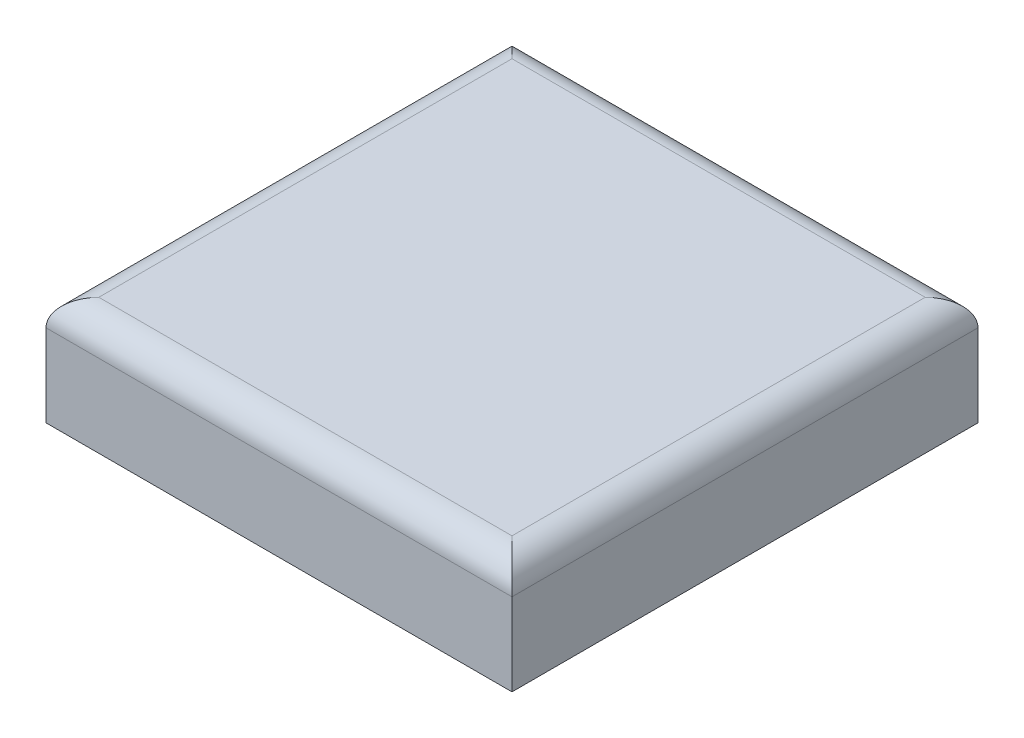
ISO-10303-21;
HEADER;
FILE_DESCRIPTION(('STEP AP214'),'2;1');
FILE_NAME('part.step','',(''),(''),'','','');
FILE_SCHEMA(('AUTOMOTIVE_DESIGN { 1 0 10303 214 1 1 1 1 }'));
ENDSEC;
DATA;
#1=APPLICATION_CONTEXT('core data for automotive mechanical design processes');
#2=APPLICATION_PROTOCOL_DEFINITION('international standard','automotive_design',2000,#1);
#3=PRODUCT_CONTEXT('',#1,'mechanical');
#4=PRODUCT('Part','Part','',(#3));
#5=PRODUCT_RELATED_PRODUCT_CATEGORY('part','',(#4));
#6=PRODUCT_DEFINITION_FORMATION('','',#4);
#7=PRODUCT_DEFINITION_CONTEXT('part definition',#1,'design');
#8=PRODUCT_DEFINITION('design','',#6,#7);
#9=PRODUCT_DEFINITION_SHAPE('','',#8);
#10=(LENGTH_UNIT() NAMED_UNIT(*) SI_UNIT(.MILLI.,.METRE.));
#11=(NAMED_UNIT(*) PLANE_ANGLE_UNIT() SI_UNIT($,.RADIAN.));
#12=(NAMED_UNIT(*) SI_UNIT($,.STERADIAN.) SOLID_ANGLE_UNIT());
#13=UNCERTAINTY_MEASURE_WITH_UNIT(LENGTH_MEASURE(1.E-05),#10,'distance_accuracy_value','');
#14=(GEOMETRIC_REPRESENTATION_CONTEXT(3) GLOBAL_UNCERTAINTY_ASSIGNED_CONTEXT((#13)) GLOBAL_UNIT_ASSIGNED_CONTEXT((#10,
#11,#12)) REPRESENTATION_CONTEXT('',''));
#15=CARTESIAN_POINT('',(0.,0.,0.));
#16=DIRECTION('',(0.,0.,1.));
#17=DIRECTION('',(1.,0.,0.));
#18=AXIS2_PLACEMENT_3D('',#15,#16,#17);
#19=CARTESIAN_POINT('',(0.,700.,0.));
#20=DIRECTION('',(1.,0.,0.));
#21=DIRECTION('',(0.,0.,-1.));
#22=AXIS2_PLACEMENT_3D('',#19,#20,#21);
#23=PLANE('',#22);
#24=DIRECTION('',(0.,-1.,0.));
#25=VECTOR('',#24,1.);
#26=CARTESIAN_POINT('',(0.,700.,0.));
#27=LINE('',#26,#25);
#28=CARTESIAN_POINT('',(0.,530.,0.));
#29=VERTEX_POINT('',#28);
#30=CARTESIAN_POINT('',(0.,0.,0.));
#31=VERTEX_POINT('',#30);
#32=EDGE_CURVE('E87',#29,#31,#27,.T.);
#33=ORIENTED_EDGE('',*,*,#32,.F.);
#34=DIRECTION('',(0.,0.,1.));
#35=VECTOR('',#34,1.);
#36=CARTESIAN_POINT('',(0.,530.,0.));
#37=LINE('',#36,#35);
#38=CARTESIAN_POINT('',(0.,530.,-3000.));
#39=VERTEX_POINT('',#38);
#40=EDGE_CURVE('E129',#29,#39,#37,.F.);
#41=ORIENTED_EDGE('',*,*,#40,.T.);
#42=DIRECTION('',(0.,-1.,0.));
#43=VECTOR('',#42,1.);
#44=CARTESIAN_POINT('',(0.,700.,-3000.));
#45=LINE('',#44,#43);
#46=CARTESIAN_POINT('',(0.,0.,-3000.));
#47=VERTEX_POINT('',#46);
#48=EDGE_CURVE('E108',#39,#47,#45,.T.);
#49=ORIENTED_EDGE('',*,*,#48,.T.);
#50=DIRECTION('',(0.,0.,1.));
#51=VECTOR('',#50,1.);
#52=CARTESIAN_POINT('',(0.,0.,0.));
#53=LINE('',#52,#51);
#54=EDGE_CURVE('E104',#47,#31,#53,.T.);
#55=ORIENTED_EDGE('',*,*,#54,.T.);
#56=EDGE_LOOP('',(#33,#41,#49,#55));
#57=FACE_BOUND('',#56,.T.);
#58=ADVANCED_FACE('F33',(#57),#23,.F.);
#59=CARTESIAN_POINT('',(0.,700.,0.));
#60=DIRECTION('',(0.,0.,-1.));
#61=DIRECTION('',(-1.,0.,0.));
#62=AXIS2_PLACEMENT_3D('',#59,#60,#61);
#63=PLANE('',#62);
#64=DIRECTION('',(0.,-1.,0.));
#65=VECTOR('',#64,1.);
#66=CARTESIAN_POINT('',(3000.,700.,0.));
#67=LINE('',#66,#65);
#68=CARTESIAN_POINT('',(3000.,530.,0.));
#69=VERTEX_POINT('',#68);
#70=CARTESIAN_POINT('',(3000.,0.,0.));
#71=VERTEX_POINT('',#70);
#72=EDGE_CURVE('E98',#69,#71,#67,.T.);
#73=ORIENTED_EDGE('',*,*,#72,.F.);
#74=DIRECTION('',(1.,0.,0.));
#75=VECTOR('',#74,1.);
#76=CARTESIAN_POINT('',(0.,530.,0.));
#77=LINE('',#76,#75);
#78=EDGE_CURVE('E11',#69,#29,#77,.F.);
#79=ORIENTED_EDGE('',*,*,#78,.T.);
#80=ORIENTED_EDGE('',*,*,#32,.T.);
#81=DIRECTION('',(1.,0.,0.));
#82=VECTOR('',#81,1.);
#83=CARTESIAN_POINT('',(0.,0.,0.));
#84=LINE('',#83,#82);
#85=EDGE_CURVE('E90',#31,#71,#84,.T.);
#86=ORIENTED_EDGE('',*,*,#85,.T.);
#87=EDGE_LOOP('',(#73,#79,#80,#86));
#88=FACE_BOUND('',#87,.T.);
#89=ADVANCED_FACE('F89',(#88),#63,.F.);
#90=CARTESIAN_POINT('',(3000.,700.,0.));
#91=DIRECTION('',(-1.,0.,0.));
#92=DIRECTION('',(0.,0.,1.));
#93=AXIS2_PLACEMENT_3D('',#90,#91,#92);
#94=PLANE('',#93);
#95=DIRECTION('',(0.,-1.,0.));
#96=VECTOR('',#95,1.);
#97=CARTESIAN_POINT('',(3000.,700.,-3000.));
#98=LINE('',#97,#96);
#99=CARTESIAN_POINT('',(3000.,530.,-3000.));
#100=VERTEX_POINT('',#99);
#101=CARTESIAN_POINT('',(3000.,0.,-3000.));
#102=VERTEX_POINT('',#101);
#103=EDGE_CURVE('E118',#100,#102,#98,.T.);
#104=ORIENTED_EDGE('',*,*,#103,.F.);
#105=DIRECTION('',(0.,0.,-1.));
#106=VECTOR('',#105,1.);
#107=CARTESIAN_POINT('',(3000.,530.,0.));
#108=LINE('',#107,#106);
#109=EDGE_CURVE('E42',#100,#69,#108,.F.);
#110=ORIENTED_EDGE('',*,*,#109,.T.);
#111=ORIENTED_EDGE('',*,*,#72,.T.);
#112=DIRECTION('',(0.,0.,-1.));
#113=VECTOR('',#112,1.);
#114=CARTESIAN_POINT('',(3000.,0.,0.));
#115=LINE('',#114,#113);
#116=EDGE_CURVE('E106',#71,#102,#115,.T.);
#117=ORIENTED_EDGE('',*,*,#116,.T.);
#118=EDGE_LOOP('',(#104,#110,#111,#117));
#119=FACE_BOUND('',#118,.T.);
#120=ADVANCED_FACE('F153',(#119),#94,.F.);
#121=CARTESIAN_POINT('',(0.,700.,-3000.));
#122=DIRECTION('',(0.,0.,1.));
#123=DIRECTION('',(1.,0.,0.));
#124=AXIS2_PLACEMENT_3D('',#121,#122,#123);
#125=PLANE('',#124);
#126=ORIENTED_EDGE('',*,*,#48,.F.);
#127=DIRECTION('',(-1.,0.,0.));
#128=VECTOR('',#127,1.);
#129=CARTESIAN_POINT('',(0.,530.,-3000.));
#130=LINE('',#129,#128);
#131=EDGE_CURVE('E57',#39,#100,#130,.F.);
#132=ORIENTED_EDGE('',*,*,#131,.T.);
#133=ORIENTED_EDGE('',*,*,#103,.T.);
#134=DIRECTION('',(-1.,0.,0.));
#135=VECTOR('',#134,1.);
#136=CARTESIAN_POINT('',(0.,0.,-3000.));
#137=LINE('',#136,#135);
#138=EDGE_CURVE('E115',#102,#47,#137,.T.);
#139=ORIENTED_EDGE('',*,*,#138,.T.);
#140=EDGE_LOOP('',(#126,#132,#133,#139));
#141=FACE_BOUND('',#140,.T.);
#142=ADVANCED_FACE('F152',(#141),#125,.F.);
#143=CARTESIAN_POINT('',(0.,700.,0.));
#144=DIRECTION('',(0.,-1.,0.));
#145=DIRECTION('',(0.,0.,-1.));
#146=AXIS2_PLACEMENT_3D('',#143,#144,#145);
#147=PLANE('',#146);
#148=DIRECTION('',(-1.,0.,0.));
#149=VECTOR('',#148,1.);
#150=CARTESIAN_POINT('',(0.,700.,-2830.));
#151=LINE('',#150,#149);
#152=CARTESIAN_POINT('',(2830.,700.,-2830.));
#153=VERTEX_POINT('',#152);
#154=CARTESIAN_POINT('',(170.,700.,-2830.));
#155=VERTEX_POINT('',#154);
#156=EDGE_CURVE('E124',#153,#155,#151,.T.);
#157=ORIENTED_EDGE('',*,*,#156,.T.);
#158=DIRECTION('',(0.,0.,1.));
#159=VECTOR('',#158,1.);
#160=CARTESIAN_POINT('',(170.,700.,0.));
#161=LINE('',#160,#159);
#162=CARTESIAN_POINT('',(170.,700.,-170.));
#163=VERTEX_POINT('',#162);
#164=EDGE_CURVE('E126',#155,#163,#161,.T.);
#165=ORIENTED_EDGE('',*,*,#164,.T.);
#166=DIRECTION('',(1.,0.,0.));
#167=VECTOR('',#166,1.);
#168=CARTESIAN_POINT('',(0.,700.,-170.));
#169=LINE('',#168,#167);
#170=CARTESIAN_POINT('',(2830.,700.,-170.));
#171=VERTEX_POINT('',#170);
#172=EDGE_CURVE('E97',#163,#171,#169,.T.);
#173=ORIENTED_EDGE('',*,*,#172,.T.);
#174=DIRECTION('',(0.,0.,-1.));
#175=VECTOR('',#174,1.);
#176=CARTESIAN_POINT('',(2830.,700.,0.));
#177=LINE('',#176,#175);
#178=EDGE_CURVE('E122',#171,#153,#177,.T.);
#179=ORIENTED_EDGE('',*,*,#178,.T.);
#180=EDGE_LOOP('',(#157,#165,#173,#179));
#181=FACE_BOUND('',#180,.T.);
#182=ADVANCED_FACE('F147',(#181),#147,.F.);
#183=CARTESIAN_POINT('',(0.,0.,0.));
#184=DIRECTION('',(0.,-1.,0.));
#185=DIRECTION('',(0.,0.,-1.));
#186=AXIS2_PLACEMENT_3D('',#183,#184,#185);
#187=PLANE('',#186);
#188=ORIENTED_EDGE('',*,*,#54,.F.);
#189=ORIENTED_EDGE('',*,*,#138,.F.);
#190=ORIENTED_EDGE('',*,*,#116,.F.);
#191=ORIENTED_EDGE('',*,*,#85,.F.);
#192=EDGE_LOOP('',(#188,#189,#190,#191));
#193=FACE_BOUND('',#192,.T.);
#194=ADVANCED_FACE('F102',(#193),#187,.T.);
#195=CARTESIAN_POINT('',(2830.,530.,0.));
#196=DIRECTION('',(0.,0.,-1.));
#197=DIRECTION('',(-1.,0.,0.));
#198=AXIS2_PLACEMENT_3D('',#195,#196,#197);
#199=CYLINDRICAL_SURFACE('',#198,170.);
#200=CARTESIAN_POINT('',(2830.,530.,-170.));
#201=DIRECTION('',(0.707106781186547,0.,-0.707106781186547));
#202=DIRECTION('',(0.707106781186547,0.,0.707106781186547));
#203=AXIS2_PLACEMENT_3D('',#200,#201,#202);
#204=ELLIPSE('',#203,240.416305603426,170.);
#205=EDGE_CURVE('E112',#69,#171,#204,.F.);
#206=ORIENTED_EDGE('',*,*,#205,.F.);
#207=ORIENTED_EDGE('',*,*,#109,.F.);
#208=CARTESIAN_POINT('',(2830.,530.,-2830.));
#209=DIRECTION('',(-0.707106781186547,0.,-0.707106781186547));
#210=DIRECTION('',(0.707106781186547,0.,-0.707106781186547));
#211=AXIS2_PLACEMENT_3D('',#208,#209,#210);
#212=ELLIPSE('',#211,240.416305603426,170.);
#213=EDGE_CURVE('E37',#153,#100,#212,.T.);
#214=ORIENTED_EDGE('',*,*,#213,.F.);
#215=ORIENTED_EDGE('',*,*,#178,.F.);
#216=EDGE_LOOP('',(#206,#207,#214,#215));
#217=FACE_BOUND('',#216,.T.);
#218=ADVANCED_FACE('F35',(#217),#199,.T.);
#219=CARTESIAN_POINT('',(0.,530.,-2830.));
#220=DIRECTION('',(-1.,0.,0.));
#221=DIRECTION('',(0.,0.,1.));
#222=AXIS2_PLACEMENT_3D('',#219,#220,#221);
#223=CYLINDRICAL_SURFACE('',#222,170.);
#224=ORIENTED_EDGE('',*,*,#213,.T.);
#225=ORIENTED_EDGE('',*,*,#131,.F.);
#226=CARTESIAN_POINT('',(170.,530.,-2830.));
#227=DIRECTION('',(-0.707106781186547,0.,0.707106781186547));
#228=DIRECTION('',(-0.707106781186547,0.,-0.707106781186547));
#229=AXIS2_PLACEMENT_3D('',#226,#227,#228);
#230=ELLIPSE('',#229,240.416305603426,170.);
#231=EDGE_CURVE('E135',#155,#39,#230,.T.);
#232=ORIENTED_EDGE('',*,*,#231,.F.);
#233=ORIENTED_EDGE('',*,*,#156,.F.);
#234=EDGE_LOOP('',(#224,#225,#232,#233));
#235=FACE_BOUND('',#234,.T.);
#236=ADVANCED_FACE('F170',(#235),#223,.T.);
#237=CARTESIAN_POINT('',(0.,530.,-170.));
#238=DIRECTION('',(1.,0.,0.));
#239=DIRECTION('',(0.,0.,-1.));
#240=AXIS2_PLACEMENT_3D('',#237,#238,#239);
#241=CYLINDRICAL_SURFACE('',#240,170.);
#242=ORIENTED_EDGE('',*,*,#205,.T.);
#243=ORIENTED_EDGE('',*,*,#172,.F.);
#244=CARTESIAN_POINT('',(170.,530.,-170.));
#245=DIRECTION('',(0.707106781186547,0.,0.707106781186547));
#246=DIRECTION('',(0.707106781186547,0.,-0.707106781186547));
#247=AXIS2_PLACEMENT_3D('',#244,#245,#246);
#248=ELLIPSE('',#247,240.416305603426,170.);
#249=EDGE_CURVE('E133',#29,#163,#248,.F.);
#250=ORIENTED_EDGE('',*,*,#249,.F.);
#251=ORIENTED_EDGE('',*,*,#78,.F.);
#252=EDGE_LOOP('',(#242,#243,#250,#251));
#253=FACE_BOUND('',#252,.T.);
#254=ADVANCED_FACE('F140',(#253),#241,.T.);
#255=CARTESIAN_POINT('',(170.,530.,0.));
#256=DIRECTION('',(0.,0.,1.));
#257=DIRECTION('',(1.,0.,0.));
#258=AXIS2_PLACEMENT_3D('',#255,#256,#257);
#259=CYLINDRICAL_SURFACE('',#258,170.);
#260=ORIENTED_EDGE('',*,*,#231,.T.);
#261=ORIENTED_EDGE('',*,*,#40,.F.);
#262=ORIENTED_EDGE('',*,*,#249,.T.);
#263=ORIENTED_EDGE('',*,*,#164,.F.);
#264=EDGE_LOOP('',(#260,#261,#262,#263));
#265=FACE_BOUND('',#264,.T.);
#266=ADVANCED_FACE('F151',(#265),#259,.T.);
#267=CLOSED_SHELL('',(#58,#89,#120,#142,#182,#194,#218,#236,#254,#266));
#268=MANIFOLD_SOLID_BREP('B2',#267);
#269=ADVANCED_BREP_SHAPE_REPRESENTATION('',(#18,#268),#14);
#270=SHAPE_DEFINITION_REPRESENTATION(#9,#269);
ENDSEC;
END-ISO-10303-21;
